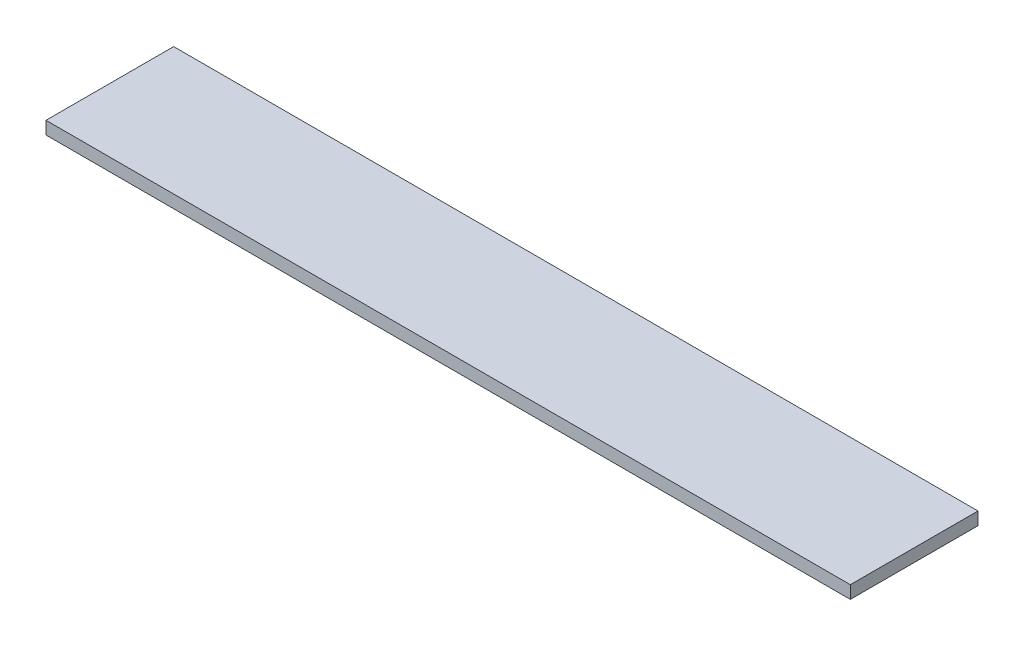
ISO-10303-21;
HEADER;
FILE_DESCRIPTION(('STEP AP214'),'2;1');
FILE_NAME('part.step','',(''),(''),'','','');
FILE_SCHEMA(('AUTOMOTIVE_DESIGN { 1 0 10303 214 1 1 1 1 }'));
ENDSEC;
DATA;
#1=APPLICATION_CONTEXT('core data for automotive mechanical design processes');
#2=APPLICATION_PROTOCOL_DEFINITION('international standard','automotive_design',2000,#1);
#3=PRODUCT_CONTEXT('',#1,'mechanical');
#4=PRODUCT('Part','Part','',(#3));
#5=PRODUCT_RELATED_PRODUCT_CATEGORY('part','',(#4));
#6=PRODUCT_DEFINITION_FORMATION('','',#4);
#7=PRODUCT_DEFINITION_CONTEXT('part definition',#1,'design');
#8=PRODUCT_DEFINITION('design','',#6,#7);
#9=PRODUCT_DEFINITION_SHAPE('','',#8);
#10=(LENGTH_UNIT() NAMED_UNIT(*) SI_UNIT(.MILLI.,.METRE.));
#11=(NAMED_UNIT(*) PLANE_ANGLE_UNIT() SI_UNIT($,.RADIAN.));
#12=(NAMED_UNIT(*) SI_UNIT($,.STERADIAN.) SOLID_ANGLE_UNIT());
#13=UNCERTAINTY_MEASURE_WITH_UNIT(LENGTH_MEASURE(1.E-05),#10,'distance_accuracy_value','');
#14=(GEOMETRIC_REPRESENTATION_CONTEXT(3) GLOBAL_UNCERTAINTY_ASSIGNED_CONTEXT((#13)) GLOBAL_UNIT_ASSIGNED_CONTEXT((#10,
#11,#12)) REPRESENTATION_CONTEXT('',''));
#15=CARTESIAN_POINT('',(0.,0.,0.));
#16=DIRECTION('',(0.,0.,1.));
#17=DIRECTION('',(1.,0.,0.));
#18=AXIS2_PLACEMENT_3D('',#15,#16,#17);
#19=CARTESIAN_POINT('',(40.005,1.27,6.35));
#20=DIRECTION('',(-1.,0.,0.));
#21=DIRECTION('',(0.,0.,1.));
#22=AXIS2_PLACEMENT_3D('',#19,#20,#21);
#23=PLANE('',#22);
#24=DIRECTION('',(0.,0.,-1.));
#25=VECTOR('',#24,1.);
#26=CARTESIAN_POINT('',(40.005,0.,6.35));
#27=LINE('',#26,#25);
#28=CARTESIAN_POINT('',(40.005,0.,6.35));
#29=VERTEX_POINT('',#28);
#30=CARTESIAN_POINT('',(40.005,0.,-6.35));
#31=VERTEX_POINT('',#30);
#32=EDGE_CURVE('E96',#29,#31,#27,.T.);
#33=ORIENTED_EDGE('',*,*,#32,.T.);
#34=DIRECTION('',(0.,-1.,0.));
#35=VECTOR('',#34,1.);
#36=CARTESIAN_POINT('',(40.005,1.27,-6.35));
#37=LINE('',#36,#35);
#38=CARTESIAN_POINT('',(40.005,1.27,-6.35));
#39=VERTEX_POINT('',#38);
#40=EDGE_CURVE('E11',#39,#31,#37,.T.);
#41=ORIENTED_EDGE('',*,*,#40,.F.);
#42=DIRECTION('',(0.,0.,-1.));
#43=VECTOR('',#42,1.);
#44=CARTESIAN_POINT('',(40.005,1.27,6.35));
#45=LINE('',#44,#43);
#46=CARTESIAN_POINT('',(40.005,1.27,6.35));
#47=VERTEX_POINT('',#46);
#48=EDGE_CURVE('E84',#47,#39,#45,.T.);
#49=ORIENTED_EDGE('',*,*,#48,.F.);
#50=DIRECTION('',(0.,-1.,0.));
#51=VECTOR('',#50,1.);
#52=CARTESIAN_POINT('',(40.005,1.27,6.35));
#53=LINE('',#52,#51);
#54=EDGE_CURVE('E92',#47,#29,#53,.T.);
#55=ORIENTED_EDGE('',*,*,#54,.T.);
#56=EDGE_LOOP('',(#33,#41,#49,#55));
#57=FACE_BOUND('',#56,.T.);
#58=ADVANCED_FACE('F33',(#57),#23,.F.);
#59=CARTESIAN_POINT('',(-40.005,1.27,-6.35));
#60=DIRECTION('',(0.,0.,1.));
#61=DIRECTION('',(1.,0.,0.));
#62=AXIS2_PLACEMENT_3D('',#59,#60,#61);
#63=PLANE('',#62);
#64=DIRECTION('',(-1.,0.,0.));
#65=VECTOR('',#64,1.);
#66=CARTESIAN_POINT('',(-40.005,0.,-6.35));
#67=LINE('',#66,#65);
#68=CARTESIAN_POINT('',(-40.005,0.,-6.35));
#69=VERTEX_POINT('',#68);
#70=EDGE_CURVE('E88',#31,#69,#67,.T.);
#71=ORIENTED_EDGE('',*,*,#70,.T.);
#72=DIRECTION('',(0.,-1.,0.));
#73=VECTOR('',#72,1.);
#74=CARTESIAN_POINT('',(-40.005,1.27,-6.35));
#75=LINE('',#74,#73);
#76=CARTESIAN_POINT('',(-40.005,1.27,-6.35));
#77=VERTEX_POINT('',#76);
#78=EDGE_CURVE('E41',#77,#69,#75,.T.);
#79=ORIENTED_EDGE('',*,*,#78,.F.);
#80=DIRECTION('',(-1.,0.,0.));
#81=VECTOR('',#80,1.);
#82=CARTESIAN_POINT('',(-40.005,1.27,-6.35));
#83=LINE('',#82,#81);
#84=EDGE_CURVE('E79',#39,#77,#83,.T.);
#85=ORIENTED_EDGE('',*,*,#84,.F.);
#86=ORIENTED_EDGE('',*,*,#40,.T.);
#87=EDGE_LOOP('',(#71,#79,#85,#86));
#88=FACE_BOUND('',#87,.T.);
#89=ADVANCED_FACE('F87',(#88),#63,.F.);
#90=CARTESIAN_POINT('',(-40.005,1.27,6.35));
#91=DIRECTION('',(1.,0.,0.));
#92=DIRECTION('',(0.,0.,-1.));
#93=AXIS2_PLACEMENT_3D('',#90,#91,#92);
#94=PLANE('',#93);
#95=DIRECTION('',(0.,0.,1.));
#96=VECTOR('',#95,1.);
#97=CARTESIAN_POINT('',(-40.005,0.,6.35));
#98=LINE('',#97,#96);
#99=CARTESIAN_POINT('',(-40.005,0.,6.35));
#100=VERTEX_POINT('',#99);
#101=EDGE_CURVE('E66',#69,#100,#98,.T.);
#102=ORIENTED_EDGE('',*,*,#101,.T.);
#103=DIRECTION('',(0.,-1.,0.));
#104=VECTOR('',#103,1.);
#105=CARTESIAN_POINT('',(-40.005,1.27,6.35));
#106=LINE('',#105,#104);
#107=CARTESIAN_POINT('',(-40.005,1.27,6.35));
#108=VERTEX_POINT('',#107);
#109=EDGE_CURVE('E89',#108,#100,#106,.T.);
#110=ORIENTED_EDGE('',*,*,#109,.F.);
#111=DIRECTION('',(0.,0.,1.));
#112=VECTOR('',#111,1.);
#113=CARTESIAN_POINT('',(-40.005,1.27,6.35));
#114=LINE('',#113,#112);
#115=EDGE_CURVE('E82',#77,#108,#114,.T.);
#116=ORIENTED_EDGE('',*,*,#115,.F.);
#117=ORIENTED_EDGE('',*,*,#78,.T.);
#118=EDGE_LOOP('',(#102,#110,#116,#117));
#119=FACE_BOUND('',#118,.T.);
#120=ADVANCED_FACE('F90',(#119),#94,.F.);
#121=CARTESIAN_POINT('',(-40.005,1.27,6.35));
#122=DIRECTION('',(0.,0.,-1.));
#123=DIRECTION('',(-1.,0.,0.));
#124=AXIS2_PLACEMENT_3D('',#121,#122,#123);
#125=PLANE('',#124);
#126=DIRECTION('',(1.,0.,0.));
#127=VECTOR('',#126,1.);
#128=CARTESIAN_POINT('',(-40.005,0.,6.35));
#129=LINE('',#128,#127);
#130=EDGE_CURVE('E72',#100,#29,#129,.T.);
#131=ORIENTED_EDGE('',*,*,#130,.T.);
#132=ORIENTED_EDGE('',*,*,#54,.F.);
#133=DIRECTION('',(1.,0.,0.));
#134=VECTOR('',#133,1.);
#135=CARTESIAN_POINT('',(-40.005,1.27,6.35));
#136=LINE('',#135,#134);
#137=EDGE_CURVE('E49',#108,#47,#136,.T.);
#138=ORIENTED_EDGE('',*,*,#137,.F.);
#139=ORIENTED_EDGE('',*,*,#109,.T.);
#140=EDGE_LOOP('',(#131,#132,#138,#139));
#141=FACE_BOUND('',#140,.T.);
#142=ADVANCED_FACE('F103',(#141),#125,.F.);
#143=CARTESIAN_POINT('',(0.,1.27,0.));
#144=DIRECTION('',(0.,-1.,0.));
#145=DIRECTION('',(0.,0.,-1.));
#146=AXIS2_PLACEMENT_3D('',#143,#144,#145);
#147=PLANE('',#146);
#148=ORIENTED_EDGE('',*,*,#48,.T.);
#149=ORIENTED_EDGE('',*,*,#84,.T.);
#150=ORIENTED_EDGE('',*,*,#115,.T.);
#151=ORIENTED_EDGE('',*,*,#137,.T.);
#152=EDGE_LOOP('',(#148,#149,#150,#151));
#153=FACE_BOUND('',#152,.T.);
#154=ADVANCED_FACE('F80',(#153),#147,.F.);
#155=CARTESIAN_POINT('',(0.,0.,0.));
#156=DIRECTION('',(0.,-1.,0.));
#157=DIRECTION('',(0.,0.,-1.));
#158=AXIS2_PLACEMENT_3D('',#155,#156,#157);
#159=PLANE('',#158);
#160=ORIENTED_EDGE('',*,*,#32,.F.);
#161=ORIENTED_EDGE('',*,*,#130,.F.);
#162=ORIENTED_EDGE('',*,*,#101,.F.);
#163=ORIENTED_EDGE('',*,*,#70,.F.);
#164=EDGE_LOOP('',(#160,#161,#162,#163));
#165=FACE_BOUND('',#164,.T.);
#166=ADVANCED_FACE('F106',(#165),#159,.T.);
#167=CLOSED_SHELL('',(#58,#89,#120,#142,#154,#166));
#168=MANIFOLD_SOLID_BREP('B2',#167);
#169=ADVANCED_BREP_SHAPE_REPRESENTATION('',(#18,#168),#14);
#170=SHAPE_DEFINITION_REPRESENTATION(#9,#169);
ENDSEC;
END-ISO-10303-21;
